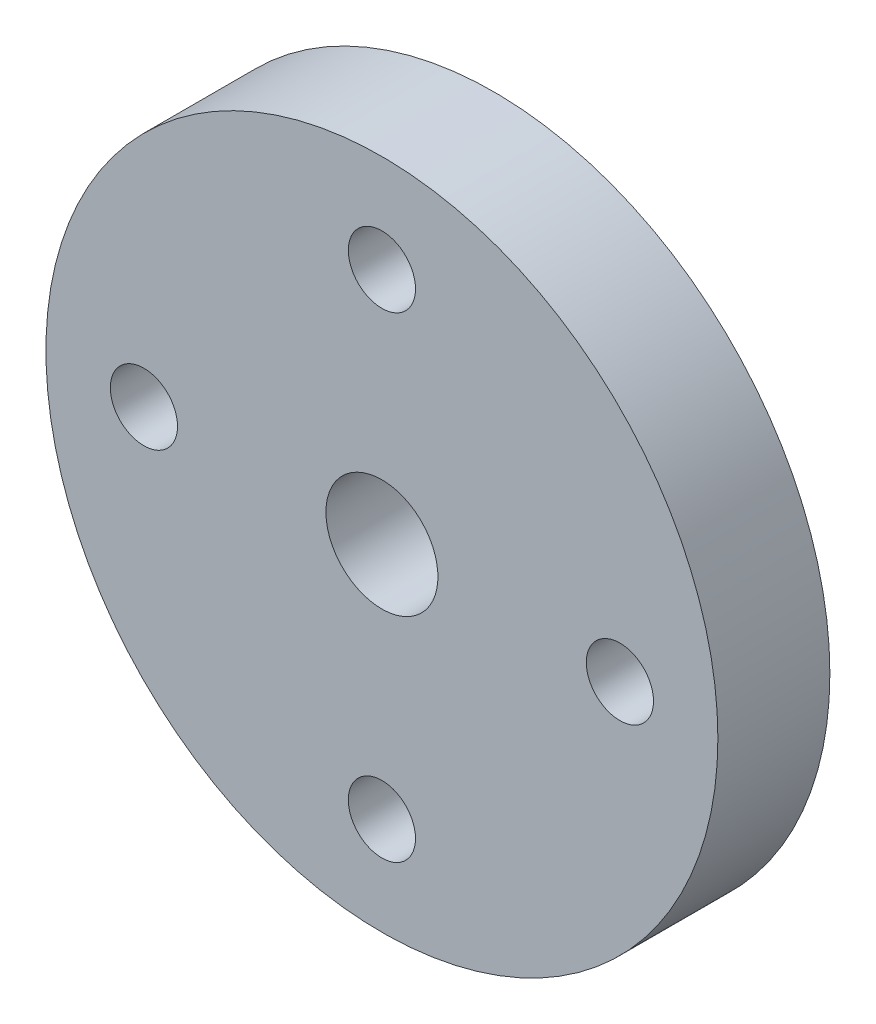
ISO-10303-21;
HEADER;
FILE_DESCRIPTION(('STEP AP214'),'2;1');
FILE_NAME('part.step','',(''),(''),'','','');
FILE_SCHEMA(('AUTOMOTIVE_DESIGN { 1 0 10303 214 1 1 1 1 }'));
ENDSEC;
DATA;
#1=APPLICATION_CONTEXT('core data for automotive mechanical design processes');
#2=APPLICATION_PROTOCOL_DEFINITION('international standard','automotive_design',2000,#1);
#3=PRODUCT_CONTEXT('',#1,'mechanical');
#4=PRODUCT('Part','Part','',(#3));
#5=PRODUCT_RELATED_PRODUCT_CATEGORY('part','',(#4));
#6=PRODUCT_DEFINITION_FORMATION('','',#4);
#7=PRODUCT_DEFINITION_CONTEXT('part definition',#1,'design');
#8=PRODUCT_DEFINITION('design','',#6,#7);
#9=PRODUCT_DEFINITION_SHAPE('','',#8);
#10=(LENGTH_UNIT() NAMED_UNIT(*) SI_UNIT(.MILLI.,.METRE.));
#11=(NAMED_UNIT(*) PLANE_ANGLE_UNIT() SI_UNIT($,.RADIAN.));
#12=(NAMED_UNIT(*) SI_UNIT($,.STERADIAN.) SOLID_ANGLE_UNIT());
#13=UNCERTAINTY_MEASURE_WITH_UNIT(LENGTH_MEASURE(1.E-05),#10,'distance_accuracy_value','');
#14=(GEOMETRIC_REPRESENTATION_CONTEXT(3) GLOBAL_UNCERTAINTY_ASSIGNED_CONTEXT((#13)) GLOBAL_UNIT_ASSIGNED_CONTEXT((#10,
#11,#12)) REPRESENTATION_CONTEXT('',''));
#15=CARTESIAN_POINT('',(0.,0.,0.));
#16=DIRECTION('',(0.,0.,1.));
#17=DIRECTION('',(1.,0.,0.));
#18=AXIS2_PLACEMENT_3D('',#15,#16,#17);
#19=CARTESIAN_POINT('',(0.,0.,10.));
#20=DIRECTION('',(0.,0.,1.));
#21=DIRECTION('',(1.,0.,0.));
#22=AXIS2_PLACEMENT_3D('',#19,#20,#21);
#23=PLANE('',#22);
#24=CARTESIAN_POINT('',(0.,0.,10.));
#25=DIRECTION('',(0.,0.,-1.));
#26=DIRECTION('',(-1.,0.,0.));
#27=AXIS2_PLACEMENT_3D('',#24,#25,#26);
#28=CIRCLE('',#27,5.);
#29=CARTESIAN_POINT('',(-5.,0.,10.));
#30=VERTEX_POINT('',#29);
#31=EDGE_CURVE('E103',#30,#30,#28,.T.);
#32=ORIENTED_EDGE('',*,*,#31,.T.);
#33=EDGE_LOOP('',(#32));
#34=FACE_BOUND('',#33,.T.);
#35=CARTESIAN_POINT('',(1.20011552744761E-12,-21.25,10.));
#36=DIRECTION('',(0.,0.,1.));
#37=DIRECTION('',(1.,0.,0.));
#38=AXIS2_PLACEMENT_3D('',#35,#36,#37);
#39=CIRCLE('',#38,3.);
#40=CARTESIAN_POINT('',(3.0000000000012,-21.25,10.));
#41=VERTEX_POINT('',#40);
#42=EDGE_CURVE('E59',#41,#41,#39,.T.);
#43=ORIENTED_EDGE('',*,*,#42,.F.);
#44=EDGE_LOOP('',(#43));
#45=FACE_BOUND('',#44,.T.);
#46=CARTESIAN_POINT('',(0.,21.25,10.));
#47=DIRECTION('',(0.,0.,1.));
#48=DIRECTION('',(1.,0.,0.));
#49=AXIS2_PLACEMENT_3D('',#46,#47,#48);
#50=CIRCLE('',#49,3.);
#51=CARTESIAN_POINT('',(3.,21.25,10.));
#52=VERTEX_POINT('',#51);
#53=EDGE_CURVE('E71',#52,#52,#50,.T.);
#54=ORIENTED_EDGE('',*,*,#53,.F.);
#55=EDGE_LOOP('',(#54));
#56=FACE_BOUND('',#55,.T.);
#57=CARTESIAN_POINT('',(0.,0.,10.));
#58=DIRECTION('',(0.,0.,1.));
#59=DIRECTION('',(1.,0.,0.));
#60=AXIS2_PLACEMENT_3D('',#57,#58,#59);
#61=CIRCLE('',#60,30.);
#62=CARTESIAN_POINT('',(30.,0.,10.));
#63=VERTEX_POINT('',#62);
#64=EDGE_CURVE('E43',#63,#63,#61,.T.);
#65=ORIENTED_EDGE('',*,*,#64,.T.);
#66=EDGE_LOOP('',(#65));
#67=FACE_BOUND('',#66,.T.);
#68=CARTESIAN_POINT('',(21.2500000000006,6.01298524860461E-13,10.));
#69=DIRECTION('',(0.,0.,1.));
#70=DIRECTION('',(1.,0.,0.));
#71=AXIS2_PLACEMENT_3D('',#68,#69,#70);
#72=CIRCLE('',#71,2.99999999999999);
#73=CARTESIAN_POINT('',(24.2500000000006,6.01298524860461E-13,10.));
#74=VERTEX_POINT('',#73);
#75=EDGE_CURVE('E65',#74,#74,#72,.T.);
#76=ORIENTED_EDGE('',*,*,#75,.F.);
#77=EDGE_LOOP('',(#76));
#78=FACE_BOUND('',#77,.T.);
#79=CARTESIAN_POINT('',(-21.2499999999994,-6.03900610074426E-13,10.));
#80=DIRECTION('',(0.,0.,1.));
#81=DIRECTION('',(1.,0.,0.));
#82=AXIS2_PLACEMENT_3D('',#79,#80,#81);
#83=CIRCLE('',#82,3.);
#84=CARTESIAN_POINT('',(-18.2499999999994,-6.03900610074426E-13,10.));
#85=VERTEX_POINT('',#84);
#86=EDGE_CURVE('E52',#85,#85,#83,.T.);
#87=ORIENTED_EDGE('',*,*,#86,.F.);
#88=EDGE_LOOP('',(#87));
#89=FACE_BOUND('',#88,.T.);
#90=ADVANCED_FACE('F35',(#34,#45,#56,#67,#78,#89),#23,.T.);
#91=CARTESIAN_POINT('',(0.,0.,0.));
#92=DIRECTION('',(0.,0.,1.));
#93=DIRECTION('',(1.,0.,0.));
#94=AXIS2_PLACEMENT_3D('',#91,#92,#93);
#95=PLANE('',#94);
#96=CARTESIAN_POINT('',(0.,0.,0.));
#97=DIRECTION('',(0.,0.,-1.));
#98=DIRECTION('',(-1.,0.,0.));
#99=AXIS2_PLACEMENT_3D('',#96,#97,#98);
#100=CIRCLE('',#99,10.);
#101=CARTESIAN_POINT('',(-10.,0.,0.));
#102=VERTEX_POINT('',#101);
#103=EDGE_CURVE('E10',#102,#102,#100,.T.);
#104=ORIENTED_EDGE('',*,*,#103,.F.);
#105=EDGE_LOOP('',(#104));
#106=FACE_BOUND('',#105,.T.);
#107=CARTESIAN_POINT('',(0.,0.,0.));
#108=DIRECTION('',(0.,0.,1.));
#109=DIRECTION('',(1.,0.,0.));
#110=AXIS2_PLACEMENT_3D('',#107,#108,#109);
#111=CIRCLE('',#110,30.);
#112=CARTESIAN_POINT('',(30.,0.,0.));
#113=VERTEX_POINT('',#112);
#114=EDGE_CURVE('E39',#113,#113,#111,.T.);
#115=ORIENTED_EDGE('',*,*,#114,.F.);
#116=EDGE_LOOP('',(#115));
#117=FACE_BOUND('',#116,.T.);
#118=CARTESIAN_POINT('',(0.,21.25,0.));
#119=DIRECTION('',(0.,0.,1.));
#120=DIRECTION('',(1.,0.,0.));
#121=AXIS2_PLACEMENT_3D('',#118,#119,#120);
#122=CIRCLE('',#121,3.);
#123=CARTESIAN_POINT('',(3.,21.25,0.));
#124=VERTEX_POINT('',#123);
#125=EDGE_CURVE('E68',#124,#124,#122,.T.);
#126=ORIENTED_EDGE('',*,*,#125,.T.);
#127=EDGE_LOOP('',(#126));
#128=FACE_BOUND('',#127,.T.);
#129=CARTESIAN_POINT('',(21.2500000000006,6.01298524860461E-13,0.));
#130=DIRECTION('',(0.,0.,1.));
#131=DIRECTION('',(1.,0.,0.));
#132=AXIS2_PLACEMENT_3D('',#129,#130,#131);
#133=CIRCLE('',#132,2.99999999999999);
#134=CARTESIAN_POINT('',(24.2500000000006,6.01298524860461E-13,0.));
#135=VERTEX_POINT('',#134);
#136=EDGE_CURVE('E62',#135,#135,#133,.T.);
#137=ORIENTED_EDGE('',*,*,#136,.T.);
#138=EDGE_LOOP('',(#137));
#139=FACE_BOUND('',#138,.T.);
#140=CARTESIAN_POINT('',(1.20011552744761E-12,-21.25,0.));
#141=DIRECTION('',(0.,0.,1.));
#142=DIRECTION('',(1.,0.,0.));
#143=AXIS2_PLACEMENT_3D('',#140,#141,#142);
#144=CIRCLE('',#143,3.);
#145=CARTESIAN_POINT('',(3.0000000000012,-21.25,0.));
#146=VERTEX_POINT('',#145);
#147=EDGE_CURVE('E55',#146,#146,#144,.T.);
#148=ORIENTED_EDGE('',*,*,#147,.T.);
#149=EDGE_LOOP('',(#148));
#150=FACE_BOUND('',#149,.T.);
#151=CARTESIAN_POINT('',(-21.2499999999994,-6.03900610074426E-13,0.));
#152=DIRECTION('',(0.,0.,1.));
#153=DIRECTION('',(1.,0.,0.));
#154=AXIS2_PLACEMENT_3D('',#151,#152,#153);
#155=CIRCLE('',#154,3.);
#156=CARTESIAN_POINT('',(-18.2499999999994,-6.03900610074426E-13,0.));
#157=VERTEX_POINT('',#156);
#158=EDGE_CURVE('E56',#157,#157,#155,.T.);
#159=ORIENTED_EDGE('',*,*,#158,.T.);
#160=EDGE_LOOP('',(#159));
#161=FACE_BOUND('',#160,.T.);
#162=ADVANCED_FACE('F77',(#106,#117,#128,#139,#150,#161),#95,.F.);
#163=CARTESIAN_POINT('',(0.,0.,10.));
#164=DIRECTION('',(0.,0.,-1.));
#165=DIRECTION('',(-1.,0.,0.));
#166=AXIS2_PLACEMENT_3D('',#163,#164,#165);
#167=CYLINDRICAL_SURFACE('',#166,30.);
#168=ORIENTED_EDGE('',*,*,#64,.F.);
#169=EDGE_LOOP('',(#168));
#170=FACE_BOUND('',#169,.T.);
#171=ORIENTED_EDGE('',*,*,#114,.T.);
#172=EDGE_LOOP('',(#171));
#173=FACE_BOUND('',#172,.T.);
#174=ADVANCED_FACE('F37',(#170,#173),#167,.T.);
#175=CARTESIAN_POINT('',(0.,21.25,10.));
#176=DIRECTION('',(0.,0.,-1.));
#177=DIRECTION('',(-1.,0.,0.));
#178=AXIS2_PLACEMENT_3D('',#175,#176,#177);
#179=CYLINDRICAL_SURFACE('',#178,3.);
#180=ORIENTED_EDGE('',*,*,#53,.T.);
#181=EDGE_LOOP('',(#180));
#182=FACE_BOUND('',#181,.T.);
#183=ORIENTED_EDGE('',*,*,#125,.F.);
#184=EDGE_LOOP('',(#183));
#185=FACE_BOUND('',#184,.T.);
#186=ADVANCED_FACE('F80',(#182,#185),#179,.F.);
#187=CARTESIAN_POINT('',(21.2500000000006,6.01298524860461E-13,10.));
#188=DIRECTION('',(0.,0.,-1.));
#189=DIRECTION('',(-1.,0.,0.));
#190=AXIS2_PLACEMENT_3D('',#187,#188,#189);
#191=CYLINDRICAL_SURFACE('',#190,2.99999999999999);
#192=ORIENTED_EDGE('',*,*,#75,.T.);
#193=EDGE_LOOP('',(#192));
#194=FACE_BOUND('',#193,.T.);
#195=ORIENTED_EDGE('',*,*,#136,.F.);
#196=EDGE_LOOP('',(#195));
#197=FACE_BOUND('',#196,.T.);
#198=ADVANCED_FACE('F82',(#194,#197),#191,.F.);
#199=CARTESIAN_POINT('',(1.20011552744761E-12,-21.25,10.));
#200=DIRECTION('',(0.,0.,-1.));
#201=DIRECTION('',(-1.,0.,0.));
#202=AXIS2_PLACEMENT_3D('',#199,#200,#201);
#203=CYLINDRICAL_SURFACE('',#202,3.);
#204=ORIENTED_EDGE('',*,*,#42,.T.);
#205=EDGE_LOOP('',(#204));
#206=FACE_BOUND('',#205,.T.);
#207=ORIENTED_EDGE('',*,*,#147,.F.);
#208=EDGE_LOOP('',(#207));
#209=FACE_BOUND('',#208,.T.);
#210=ADVANCED_FACE('F89',(#206,#209),#203,.F.);
#211=CARTESIAN_POINT('',(-21.2499999999994,-6.03900610074426E-13,10.));
#212=DIRECTION('',(0.,0.,-1.));
#213=DIRECTION('',(-1.,0.,0.));
#214=AXIS2_PLACEMENT_3D('',#211,#212,#213);
#215=CYLINDRICAL_SURFACE('',#214,3.);
#216=ORIENTED_EDGE('',*,*,#86,.T.);
#217=EDGE_LOOP('',(#216));
#218=FACE_BOUND('',#217,.T.);
#219=ORIENTED_EDGE('',*,*,#158,.F.);
#220=EDGE_LOOP('',(#219));
#221=FACE_BOUND('',#220,.T.);
#222=ADVANCED_FACE('F114',(#218,#221),#215,.F.);
#223=CARTESIAN_POINT('',(0.,0.,-10.));
#224=DIRECTION('',(0.,0.,1.));
#225=DIRECTION('',(1.,0.,0.));
#226=AXIS2_PLACEMENT_3D('',#223,#224,#225);
#227=CYLINDRICAL_SURFACE('',#226,10.);
#228=CARTESIAN_POINT('',(0.,0.,-10.));
#229=DIRECTION('',(0.,0.,-1.));
#230=DIRECTION('',(-1.,0.,0.));
#231=AXIS2_PLACEMENT_3D('',#228,#229,#230);
#232=CIRCLE('',#231,10.);
#233=CARTESIAN_POINT('',(-10.,0.,-10.));
#234=VERTEX_POINT('',#233);
#235=EDGE_CURVE('E50',#234,#234,#232,.T.);
#236=ORIENTED_EDGE('',*,*,#235,.F.);
#237=EDGE_LOOP('',(#236));
#238=FACE_BOUND('',#237,.T.);
#239=ORIENTED_EDGE('',*,*,#103,.T.);
#240=EDGE_LOOP('',(#239));
#241=FACE_BOUND('',#240,.T.);
#242=ADVANCED_FACE('F117',(#238,#241),#227,.T.);
#243=CARTESIAN_POINT('',(0.,0.,-10.));
#244=DIRECTION('',(0.,0.,-1.));
#245=DIRECTION('',(-1.,0.,0.));
#246=AXIS2_PLACEMENT_3D('',#243,#244,#245);
#247=PLANE('',#246);
#248=CARTESIAN_POINT('',(0.,0.,-10.));
#249=DIRECTION('',(0.,0.,-1.));
#250=DIRECTION('',(-1.,0.,0.));
#251=AXIS2_PLACEMENT_3D('',#248,#249,#250);
#252=CIRCLE('',#251,5.);
#253=CARTESIAN_POINT('',(-5.,0.,-10.));
#254=VERTEX_POINT('',#253);
#255=EDGE_CURVE('E142',#254,#254,#252,.T.);
#256=ORIENTED_EDGE('',*,*,#255,.F.);
#257=EDGE_LOOP('',(#256));
#258=FACE_BOUND('',#257,.T.);
#259=ORIENTED_EDGE('',*,*,#235,.T.);
#260=EDGE_LOOP('',(#259));
#261=FACE_BOUND('',#260,.T.);
#262=ADVANCED_FACE('F125',(#258,#261),#247,.T.);
#263=CARTESIAN_POINT('',(0.,0.,10.));
#264=DIRECTION('',(0.,0.,-1.));
#265=DIRECTION('',(-1.,0.,0.));
#266=AXIS2_PLACEMENT_3D('',#263,#264,#265);
#267=CYLINDRICAL_SURFACE('',#266,5.);
#268=ORIENTED_EDGE('',*,*,#31,.F.);
#269=EDGE_LOOP('',(#268));
#270=FACE_BOUND('',#269,.T.);
#271=ORIENTED_EDGE('',*,*,#255,.T.);
#272=EDGE_LOOP('',(#271));
#273=FACE_BOUND('',#272,.T.);
#274=ADVANCED_FACE('F133',(#270,#273),#267,.F.);
#275=CLOSED_SHELL('',(#90,#162,#174,#186,#198,#210,#222,#242,#262,#274));
#276=MANIFOLD_SOLID_BREP('B2',#275);
#277=ADVANCED_BREP_SHAPE_REPRESENTATION('',(#18,#276),#14);
#278=SHAPE_DEFINITION_REPRESENTATION(#9,#277);
ENDSEC;
END-ISO-10303-21;
